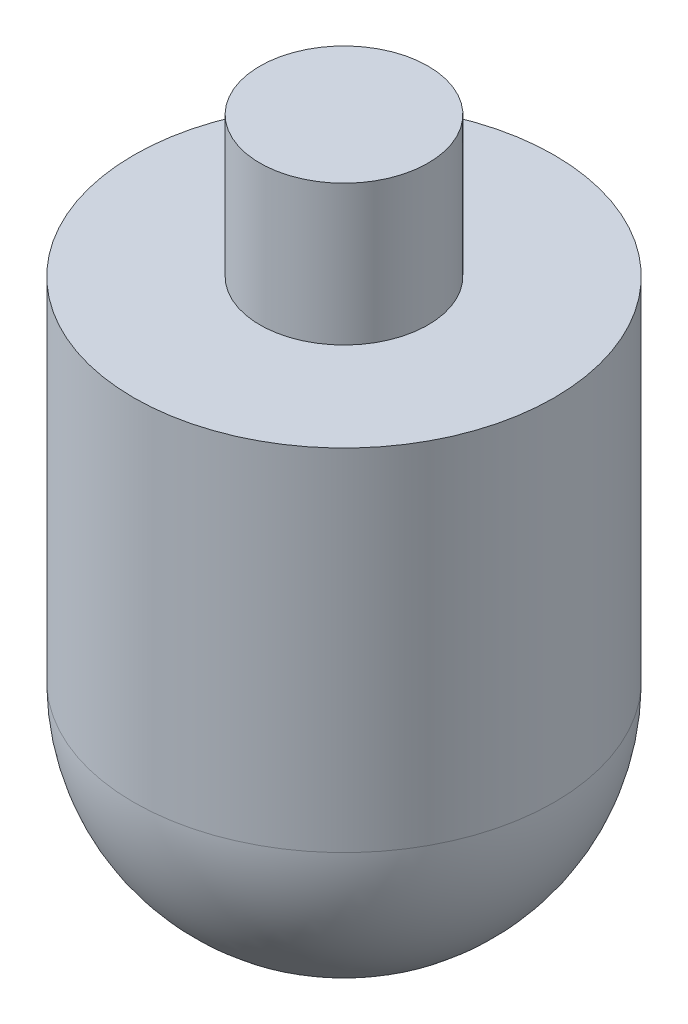
ISO-10303-21;
HEADER;
FILE_DESCRIPTION(('STEP AP214'),'2;1');
FILE_NAME('part.step','',(''),(''),'','','');
FILE_SCHEMA(('AUTOMOTIVE_DESIGN { 1 0 10303 214 1 1 1 1 }'));
ENDSEC;
DATA;
#1=APPLICATION_CONTEXT('core data for automotive mechanical design processes');
#2=APPLICATION_PROTOCOL_DEFINITION('international standard','automotive_design',2000,#1);
#3=PRODUCT_CONTEXT('',#1,'mechanical');
#4=PRODUCT('Part','Part','',(#3));
#5=PRODUCT_RELATED_PRODUCT_CATEGORY('part','',(#4));
#6=PRODUCT_DEFINITION_FORMATION('','',#4);
#7=PRODUCT_DEFINITION_CONTEXT('part definition',#1,'design');
#8=PRODUCT_DEFINITION('design','',#6,#7);
#9=PRODUCT_DEFINITION_SHAPE('','',#8);
#10=(LENGTH_UNIT() NAMED_UNIT(*) SI_UNIT(.MILLI.,.METRE.));
#11=(NAMED_UNIT(*) PLANE_ANGLE_UNIT() SI_UNIT($,.RADIAN.));
#12=(NAMED_UNIT(*) SI_UNIT($,.STERADIAN.) SOLID_ANGLE_UNIT());
#13=UNCERTAINTY_MEASURE_WITH_UNIT(LENGTH_MEASURE(1.E-05),#10,'distance_accuracy_value','');
#14=(GEOMETRIC_REPRESENTATION_CONTEXT(3) GLOBAL_UNCERTAINTY_ASSIGNED_CONTEXT((#13)) GLOBAL_UNIT_ASSIGNED_CONTEXT((#10,
#11,#12)) REPRESENTATION_CONTEXT('',''));
#15=CARTESIAN_POINT('',(0.,0.,0.));
#16=DIRECTION('',(0.,0.,1.));
#17=DIRECTION('',(1.,0.,0.));
#18=AXIS2_PLACEMENT_3D('',#15,#16,#17);
#19=CARTESIAN_POINT('',(0.,0.,0.));
#20=DIRECTION('',(0.,-1.,0.));
#21=DIRECTION('',(-1.,0.,0.));
#22=AXIS2_PLACEMENT_3D('',#19,#20,#21);
#23=SPHERICAL_SURFACE('',#22,15.);
#24=CARTESIAN_POINT('',(0.,0.,0.));
#25=DIRECTION('',(0.,-1.,0.));
#26=DIRECTION('',(0.,0.,-1.));
#27=AXIS2_PLACEMENT_3D('',#24,#25,#26);
#28=CIRCLE('',#27,15.);
#29=CARTESIAN_POINT('',(0.,0.,-15.));
#30=VERTEX_POINT('',#29);
#31=EDGE_CURVE('E10',#30,#30,#28,.T.);
#32=ORIENTED_EDGE('',*,*,#31,.T.);
#33=EDGE_LOOP('',(#32));
#34=FACE_BOUND('',#33,.T.);
#35=ADVANCED_FACE('F31',(#34),#23,.T.);
#36=CARTESIAN_POINT('',(0.,0.,0.));
#37=DIRECTION('',(0.,-1.,0.));
#38=DIRECTION('',(0.,0.,-1.));
#39=AXIS2_PLACEMENT_3D('',#36,#37,#38);
#40=CYLINDRICAL_SURFACE('',#39,15.);
#41=CARTESIAN_POINT('',(0.,25.,0.));
#42=DIRECTION('',(0.,-1.,0.));
#43=DIRECTION('',(0.,0.,-1.));
#44=AXIS2_PLACEMENT_3D('',#41,#42,#43);
#45=CIRCLE('',#44,15.);
#46=CARTESIAN_POINT('',(0.,25.,-15.));
#47=VERTEX_POINT('',#46);
#48=EDGE_CURVE('E37',#47,#47,#45,.T.);
#49=ORIENTED_EDGE('',*,*,#48,.T.);
#50=EDGE_LOOP('',(#49));
#51=FACE_BOUND('',#50,.T.);
#52=ORIENTED_EDGE('',*,*,#31,.F.);
#53=EDGE_LOOP('',(#52));
#54=FACE_BOUND('',#53,.T.);
#55=ADVANCED_FACE('F63',(#51,#54),#40,.T.);
#56=CARTESIAN_POINT('',(6.,25.,0.));
#57=DIRECTION('',(0.,1.,0.));
#58=DIRECTION('',(0.,0.,1.));
#59=AXIS2_PLACEMENT_3D('',#56,#57,#58);
#60=PLANE('',#59);
#61=CARTESIAN_POINT('',(0.,25.,0.));
#62=DIRECTION('',(0.,-1.,0.));
#63=DIRECTION('',(0.,0.,-1.));
#64=AXIS2_PLACEMENT_3D('',#61,#62,#63);
#65=CIRCLE('',#64,6.);
#66=CARTESIAN_POINT('',(0.,25.,-6.));
#67=VERTEX_POINT('',#66);
#68=EDGE_CURVE('E41',#67,#67,#65,.T.);
#69=ORIENTED_EDGE('',*,*,#68,.T.);
#70=EDGE_LOOP('',(#69));
#71=FACE_BOUND('',#70,.T.);
#72=ORIENTED_EDGE('',*,*,#48,.F.);
#73=EDGE_LOOP('',(#72));
#74=FACE_BOUND('',#73,.T.);
#75=ADVANCED_FACE('F60',(#71,#74),#60,.T.);
#76=CARTESIAN_POINT('',(0.,0.,0.));
#77=DIRECTION('',(0.,-1.,0.));
#78=DIRECTION('',(0.,0.,-1.));
#79=AXIS2_PLACEMENT_3D('',#76,#77,#78);
#80=CYLINDRICAL_SURFACE('',#79,6.);
#81=CARTESIAN_POINT('',(0.,35.,0.));
#82=DIRECTION('',(0.,-1.,0.));
#83=DIRECTION('',(0.,0.,-1.));
#84=AXIS2_PLACEMENT_3D('',#81,#82,#83);
#85=CIRCLE('',#84,6.);
#86=CARTESIAN_POINT('',(0.,35.,-6.));
#87=VERTEX_POINT('',#86);
#88=EDGE_CURVE('E45',#87,#87,#85,.T.);
#89=ORIENTED_EDGE('',*,*,#88,.T.);
#90=EDGE_LOOP('',(#89));
#91=FACE_BOUND('',#90,.T.);
#92=ORIENTED_EDGE('',*,*,#68,.F.);
#93=EDGE_LOOP('',(#92));
#94=FACE_BOUND('',#93,.T.);
#95=ADVANCED_FACE('F51',(#91,#94),#80,.T.);
#96=CARTESIAN_POINT('',(0.,35.,0.));
#97=DIRECTION('',(0.,1.,0.));
#98=DIRECTION('',(0.,0.,1.));
#99=AXIS2_PLACEMENT_3D('',#96,#97,#98);
#100=PLANE('',#99);
#101=ORIENTED_EDGE('',*,*,#88,.F.);
#102=EDGE_LOOP('',(#101));
#103=FACE_BOUND('',#102,.T.);
#104=ADVANCED_FACE('F54',(#103),#100,.T.);
#105=CLOSED_SHELL('',(#35,#55,#75,#95,#104));
#106=MANIFOLD_SOLID_BREP('B2',#105);
#107=ADVANCED_BREP_SHAPE_REPRESENTATION('',(#18,#106),#14);
#108=SHAPE_DEFINITION_REPRESENTATION(#9,#107);
ENDSEC;
END-ISO-10303-21;
